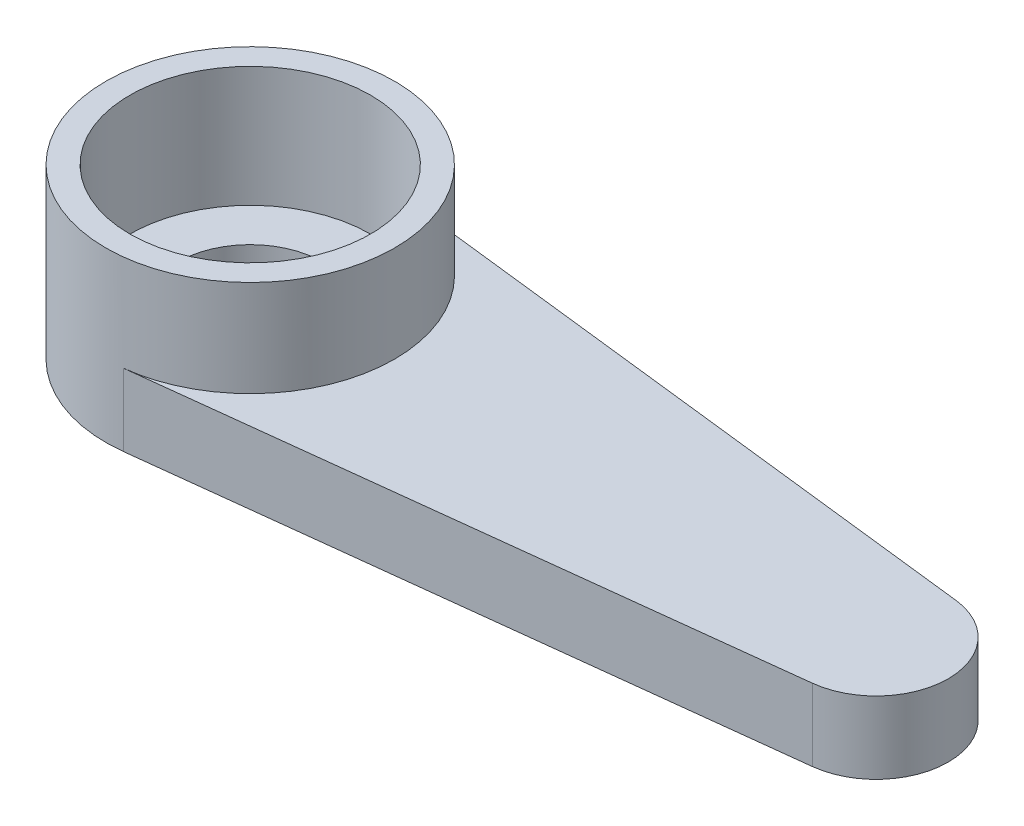
ISO-10303-21;
HEADER;
FILE_DESCRIPTION(('STEP AP214'),'2;1');
FILE_NAME('part.step','',(''),(''),'','','');
FILE_SCHEMA(('AUTOMOTIVE_DESIGN { 1 0 10303 214 1 1 1 1 }'));
ENDSEC;
DATA;
#1=APPLICATION_CONTEXT('core data for automotive mechanical design processes');
#2=APPLICATION_PROTOCOL_DEFINITION('international standard','automotive_design',2000,#1);
#3=PRODUCT_CONTEXT('',#1,'mechanical');
#4=PRODUCT('Part','Part','',(#3));
#5=PRODUCT_RELATED_PRODUCT_CATEGORY('part','',(#4));
#6=PRODUCT_DEFINITION_FORMATION('','',#4);
#7=PRODUCT_DEFINITION_CONTEXT('part definition',#1,'design');
#8=PRODUCT_DEFINITION('design','',#6,#7);
#9=PRODUCT_DEFINITION_SHAPE('','',#8);
#10=(LENGTH_UNIT() NAMED_UNIT(*) SI_UNIT(.MILLI.,.METRE.));
#11=(NAMED_UNIT(*) PLANE_ANGLE_UNIT() SI_UNIT($,.RADIAN.));
#12=(NAMED_UNIT(*) SI_UNIT($,.STERADIAN.) SOLID_ANGLE_UNIT());
#13=UNCERTAINTY_MEASURE_WITH_UNIT(LENGTH_MEASURE(1.E-05),#10,'distance_accuracy_value','');
#14=(GEOMETRIC_REPRESENTATION_CONTEXT(3) GLOBAL_UNCERTAINTY_ASSIGNED_CONTEXT((#13)) GLOBAL_UNIT_ASSIGNED_CONTEXT((#10,
#11,#12)) REPRESENTATION_CONTEXT('',''));
#15=CARTESIAN_POINT('',(0.,0.,0.));
#16=DIRECTION('',(0.,0.,1.));
#17=DIRECTION('',(1.,0.,0.));
#18=AXIS2_PLACEMENT_3D('',#15,#16,#17);
#19=CARTESIAN_POINT('',(0.,1.5,0.));
#20=DIRECTION('',(0.,-1.,0.));
#21=DIRECTION('',(0.,0.,-1.));
#22=AXIS2_PLACEMENT_3D('',#19,#20,#21);
#23=CYLINDRICAL_SURFACE('',#22,1.5);
#24=CARTESIAN_POINT('',(0.,0.,0.));
#25=DIRECTION('',(0.,1.,0.));
#26=DIRECTION('',(0.,0.,1.));
#27=AXIS2_PLACEMENT_3D('',#24,#25,#26);
#28=CIRCLE('',#27,1.5);
#29=CARTESIAN_POINT('',(0.,0.,1.5));
#30=VERTEX_POINT('',#29);
#31=EDGE_CURVE('E101',#30,#30,#28,.T.);
#32=ORIENTED_EDGE('',*,*,#31,.F.);
#33=EDGE_LOOP('',(#32));
#34=FACE_BOUND('',#33,.T.);
#35=CARTESIAN_POINT('',(0.,1.,0.));
#36=DIRECTION('',(0.,1.,0.));
#37=DIRECTION('',(0.,0.,1.));
#38=AXIS2_PLACEMENT_3D('',#35,#36,#37);
#39=CIRCLE('',#38,1.5);
#40=CARTESIAN_POINT('',(0.,1.,1.5));
#41=VERTEX_POINT('',#40);
#42=EDGE_CURVE('E39',#41,#41,#39,.T.);
#43=ORIENTED_EDGE('',*,*,#42,.T.);
#44=EDGE_LOOP('',(#43));
#45=FACE_BOUND('',#44,.T.);
#46=ADVANCED_FACE('F35',(#34,#45),#23,.F.);
#47=CARTESIAN_POINT('',(0.,1.5,0.));
#48=DIRECTION('',(0.,1.,0.));
#49=DIRECTION('',(0.,0.,1.));
#50=AXIS2_PLACEMENT_3D('',#47,#48,#49);
#51=PLANE('',#50);
#52=CARTESIAN_POINT('',(0.,1.5,0.));
#53=DIRECTION('',(0.,1.,0.));
#54=DIRECTION('',(0.,0.,1.));
#55=AXIS2_PLACEMENT_3D('',#52,#53,#54);
#56=CIRCLE('',#55,3.);
#57=CARTESIAN_POINT('',(0.346153846153846,1.5,2.97996267003345));
#58=VERTEX_POINT('',#57);
#59=CARTESIAN_POINT('',(0.346153846153846,1.5,-2.97996267003345));
#60=VERTEX_POINT('',#59);
#61=EDGE_CURVE('E88',#58,#60,#56,.T.);
#62=ORIENTED_EDGE('',*,*,#61,.F.);
#63=DIRECTION('',(0.993320890011151,0.,-0.115384615384615));
#64=VECTOR('',#63,1.);
#65=CARTESIAN_POINT('',(13.1730769230769,1.5,1.48998133501673));
#66=LINE('',#65,#64);
#67=CARTESIAN_POINT('',(13.1730769230769,1.5,1.48998133501673));
#68=VERTEX_POINT('',#67);
#69=EDGE_CURVE('E80',#58,#68,#66,.T.);
#70=ORIENTED_EDGE('',*,*,#69,.T.);
#71=CARTESIAN_POINT('',(13.,1.5,0.));
#72=DIRECTION('',(0.,1.,0.));
#73=DIRECTION('',(0.,0.,1.));
#74=AXIS2_PLACEMENT_3D('',#71,#72,#73);
#75=CIRCLE('',#74,1.5);
#76=CARTESIAN_POINT('',(13.1730769230769,1.5,-1.48998133501673));
#77=VERTEX_POINT('',#76);
#78=EDGE_CURVE('E94',#68,#77,#75,.T.);
#79=ORIENTED_EDGE('',*,*,#78,.T.);
#80=DIRECTION('',(-0.993320890011151,0.,-0.115384615384615));
#81=VECTOR('',#80,1.);
#82=CARTESIAN_POINT('',(0.346153846153846,1.5,-2.97996267003345));
#83=LINE('',#82,#81);
#84=EDGE_CURVE('E53',#77,#60,#83,.T.);
#85=ORIENTED_EDGE('',*,*,#84,.T.);
#86=EDGE_LOOP('',(#62,#70,#79,#85));
#87=FACE_BOUND('',#86,.T.);
#88=ADVANCED_FACE('F96',(#87),#51,.T.);
#89=CARTESIAN_POINT('',(0.,0.,0.));
#90=DIRECTION('',(0.,1.,0.));
#91=DIRECTION('',(0.,0.,1.));
#92=AXIS2_PLACEMENT_3D('',#89,#90,#91);
#93=PLANE('',#92);
#94=CARTESIAN_POINT('',(0.,0.,0.));
#95=DIRECTION('',(0.,1.,0.));
#96=DIRECTION('',(0.,0.,1.));
#97=AXIS2_PLACEMENT_3D('',#94,#95,#96);
#98=CIRCLE('',#97,3.);
#99=CARTESIAN_POINT('',(0.346153846153846,0.,-2.97996267003345));
#100=VERTEX_POINT('',#99);
#101=CARTESIAN_POINT('',(0.346153846153846,0.,2.97996267003345));
#102=VERTEX_POINT('',#101);
#103=EDGE_CURVE('E90',#100,#102,#98,.T.);
#104=ORIENTED_EDGE('',*,*,#103,.F.);
#105=DIRECTION('',(-0.993320890011151,0.,-0.115384615384615));
#106=VECTOR('',#105,1.);
#107=CARTESIAN_POINT('',(0.346153846153846,0.,-2.97996267003345));
#108=LINE('',#107,#106);
#109=CARTESIAN_POINT('',(13.1730769230769,0.,-1.48998133501673));
#110=VERTEX_POINT('',#109);
#111=EDGE_CURVE('E76',#110,#100,#108,.T.);
#112=ORIENTED_EDGE('',*,*,#111,.F.);
#113=CARTESIAN_POINT('',(13.,0.,0.));
#114=DIRECTION('',(0.,1.,0.));
#115=DIRECTION('',(0.,0.,1.));
#116=AXIS2_PLACEMENT_3D('',#113,#114,#115);
#117=CIRCLE('',#116,1.5);
#118=CARTESIAN_POINT('',(13.1730769230769,0.,1.48998133501673));
#119=VERTEX_POINT('',#118);
#120=EDGE_CURVE('E71',#119,#110,#117,.T.);
#121=ORIENTED_EDGE('',*,*,#120,.F.);
#122=DIRECTION('',(0.993320890011151,0.,-0.115384615384615));
#123=VECTOR('',#122,1.);
#124=CARTESIAN_POINT('',(13.1730769230769,0.,1.48998133501673));
#125=LINE('',#124,#123);
#126=EDGE_CURVE('E112',#102,#119,#125,.T.);
#127=ORIENTED_EDGE('',*,*,#126,.F.);
#128=EDGE_LOOP('',(#104,#112,#121,#127));
#129=FACE_BOUND('',#128,.T.);
#130=ORIENTED_EDGE('',*,*,#31,.T.);
#131=EDGE_LOOP('',(#130));
#132=FACE_BOUND('',#131,.T.);
#133=ADVANCED_FACE('F121',(#129,#132),#93,.F.);
#134=CARTESIAN_POINT('',(0.,1.5,0.));
#135=DIRECTION('',(0.,-1.,0.));
#136=DIRECTION('',(0.,0.,-1.));
#137=AXIS2_PLACEMENT_3D('',#134,#135,#136);
#138=CYLINDRICAL_SURFACE('',#137,3.);
#139=ORIENTED_EDGE('',*,*,#103,.T.);
#140=DIRECTION('',(0.,-1.,0.));
#141=VECTOR('',#140,1.);
#142=CARTESIAN_POINT('',(0.346153846153846,1.5,2.97996267003345));
#143=LINE('',#142,#141);
#144=EDGE_CURVE('E11',#58,#102,#143,.T.);
#145=ORIENTED_EDGE('',*,*,#144,.F.);
#146=ORIENTED_EDGE('',*,*,#61,.T.);
#147=DIRECTION('',(0.,-1.,0.));
#148=VECTOR('',#147,1.);
#149=CARTESIAN_POINT('',(0.346153846153846,1.5,-2.97996267003345));
#150=LINE('',#149,#148);
#151=EDGE_CURVE('E110',#60,#100,#150,.T.);
#152=ORIENTED_EDGE('',*,*,#151,.T.);
#153=EDGE_LOOP('',(#139,#145,#146,#152));
#154=FACE_BOUND('',#153,.T.);
#155=CARTESIAN_POINT('',(0.,3.5,0.));
#156=DIRECTION('',(0.,1.,0.));
#157=DIRECTION('',(0.,0.,1.));
#158=AXIS2_PLACEMENT_3D('',#155,#156,#157);
#159=CIRCLE('',#158,3.);
#160=CARTESIAN_POINT('',(0.,3.5,3.));
#161=VERTEX_POINT('',#160);
#162=EDGE_CURVE('E97',#161,#161,#159,.T.);
#163=ORIENTED_EDGE('',*,*,#162,.F.);
#164=EDGE_LOOP('',(#163));
#165=FACE_BOUND('',#164,.T.);
#166=ADVANCED_FACE('F37',(#154,#165),#138,.T.);
#167=CARTESIAN_POINT('',(13.1730769230769,1.5,1.48998133501673));
#168=DIRECTION('',(-0.115384615384615,0.,-0.993320890011151));
#169=DIRECTION('',(-0.993320890011151,0.,0.115384615384615));
#170=AXIS2_PLACEMENT_3D('',#167,#168,#169);
#171=PLANE('',#170);
#172=ORIENTED_EDGE('',*,*,#126,.T.);
#173=DIRECTION('',(0.,-1.,0.));
#174=VECTOR('',#173,1.);
#175=CARTESIAN_POINT('',(13.1730769230769,1.5,1.48998133501673));
#176=LINE('',#175,#174);
#177=EDGE_CURVE('E45',#68,#119,#176,.T.);
#178=ORIENTED_EDGE('',*,*,#177,.F.);
#179=ORIENTED_EDGE('',*,*,#69,.F.);
#180=ORIENTED_EDGE('',*,*,#144,.T.);
#181=EDGE_LOOP('',(#172,#178,#179,#180));
#182=FACE_BOUND('',#181,.T.);
#183=ADVANCED_FACE('F92',(#182),#171,.F.);
#184=CARTESIAN_POINT('',(13.,1.5,0.));
#185=DIRECTION('',(0.,-1.,0.));
#186=DIRECTION('',(0.,0.,-1.));
#187=AXIS2_PLACEMENT_3D('',#184,#185,#186);
#188=CYLINDRICAL_SURFACE('',#187,1.5);
#189=ORIENTED_EDGE('',*,*,#120,.T.);
#190=DIRECTION('',(0.,-1.,0.));
#191=VECTOR('',#190,1.);
#192=CARTESIAN_POINT('',(13.1730769230769,1.5,-1.48998133501673));
#193=LINE('',#192,#191);
#194=EDGE_CURVE('E117',#77,#110,#193,.T.);
#195=ORIENTED_EDGE('',*,*,#194,.F.);
#196=ORIENTED_EDGE('',*,*,#78,.F.);
#197=ORIENTED_EDGE('',*,*,#177,.T.);
#198=EDGE_LOOP('',(#189,#195,#196,#197));
#199=FACE_BOUND('',#198,.T.);
#200=ADVANCED_FACE('F119',(#199),#188,.T.);
#201=CARTESIAN_POINT('',(0.346153846153846,1.5,-2.97996267003345));
#202=DIRECTION('',(-0.115384615384615,0.,0.99332089001115));
#203=DIRECTION('',(0.993320890011151,0.,0.115384615384615));
#204=AXIS2_PLACEMENT_3D('',#201,#202,#203);
#205=PLANE('',#204);
#206=ORIENTED_EDGE('',*,*,#111,.T.);
#207=ORIENTED_EDGE('',*,*,#151,.F.);
#208=ORIENTED_EDGE('',*,*,#84,.F.);
#209=ORIENTED_EDGE('',*,*,#194,.T.);
#210=EDGE_LOOP('',(#206,#207,#208,#209));
#211=FACE_BOUND('',#210,.T.);
#212=ADVANCED_FACE('F150',(#211),#205,.F.);
#213=CARTESIAN_POINT('',(0.,3.5,0.));
#214=DIRECTION('',(0.,1.,0.));
#215=DIRECTION('',(0.,0.,1.));
#216=AXIS2_PLACEMENT_3D('',#213,#214,#215);
#217=PLANE('',#216);
#218=ORIENTED_EDGE('',*,*,#162,.T.);
#219=EDGE_LOOP('',(#218));
#220=FACE_BOUND('',#219,.T.);
#221=CARTESIAN_POINT('',(0.,3.5,0.));
#222=DIRECTION('',(0.,1.,0.));
#223=DIRECTION('',(0.,0.,1.));
#224=AXIS2_PLACEMENT_3D('',#221,#222,#223);
#225=CIRCLE('',#224,2.5);
#226=CARTESIAN_POINT('',(0.,3.5,2.5));
#227=VERTEX_POINT('',#226);
#228=EDGE_CURVE('E98',#227,#227,#225,.T.);
#229=ORIENTED_EDGE('',*,*,#228,.F.);
#230=EDGE_LOOP('',(#229));
#231=FACE_BOUND('',#230,.T.);
#232=ADVANCED_FACE('F142',(#220,#231),#217,.T.);
#233=CARTESIAN_POINT('',(0.,3.5,0.));
#234=DIRECTION('',(0.,-1.,0.));
#235=DIRECTION('',(0.,0.,-1.));
#236=AXIS2_PLACEMENT_3D('',#233,#234,#235);
#237=CYLINDRICAL_SURFACE('',#236,2.5);
#238=ORIENTED_EDGE('',*,*,#228,.T.);
#239=EDGE_LOOP('',(#238));
#240=FACE_BOUND('',#239,.T.);
#241=CARTESIAN_POINT('',(0.,1.,0.));
#242=DIRECTION('',(0.,1.,0.));
#243=DIRECTION('',(0.,0.,1.));
#244=AXIS2_PLACEMENT_3D('',#241,#242,#243);
#245=CIRCLE('',#244,2.5);
#246=CARTESIAN_POINT('',(0.,1.,2.5));
#247=VERTEX_POINT('',#246);
#248=EDGE_CURVE('E133',#247,#247,#245,.T.);
#249=ORIENTED_EDGE('',*,*,#248,.F.);
#250=EDGE_LOOP('',(#249));
#251=FACE_BOUND('',#250,.T.);
#252=ADVANCED_FACE('F140',(#240,#251),#237,.F.);
#253=CARTESIAN_POINT('',(0.,1.,0.));
#254=DIRECTION('',(0.,1.,0.));
#255=DIRECTION('',(0.,0.,1.));
#256=AXIS2_PLACEMENT_3D('',#253,#254,#255);
#257=PLANE('',#256);
#258=ORIENTED_EDGE('',*,*,#42,.F.);
#259=EDGE_LOOP('',(#258));
#260=FACE_BOUND('',#259,.T.);
#261=ORIENTED_EDGE('',*,*,#248,.T.);
#262=EDGE_LOOP('',(#261));
#263=FACE_BOUND('',#262,.T.);
#264=ADVANCED_FACE('F138',(#260,#263),#257,.T.);
#265=CLOSED_SHELL('',(#46,#88,#133,#166,#183,#200,#212,#232,#252,#264));
#266=MANIFOLD_SOLID_BREP('B2',#265);
#267=ADVANCED_BREP_SHAPE_REPRESENTATION('',(#18,#266),#14);
#268=SHAPE_DEFINITION_REPRESENTATION(#9,#267);
ENDSEC;
END-ISO-10303-21;
